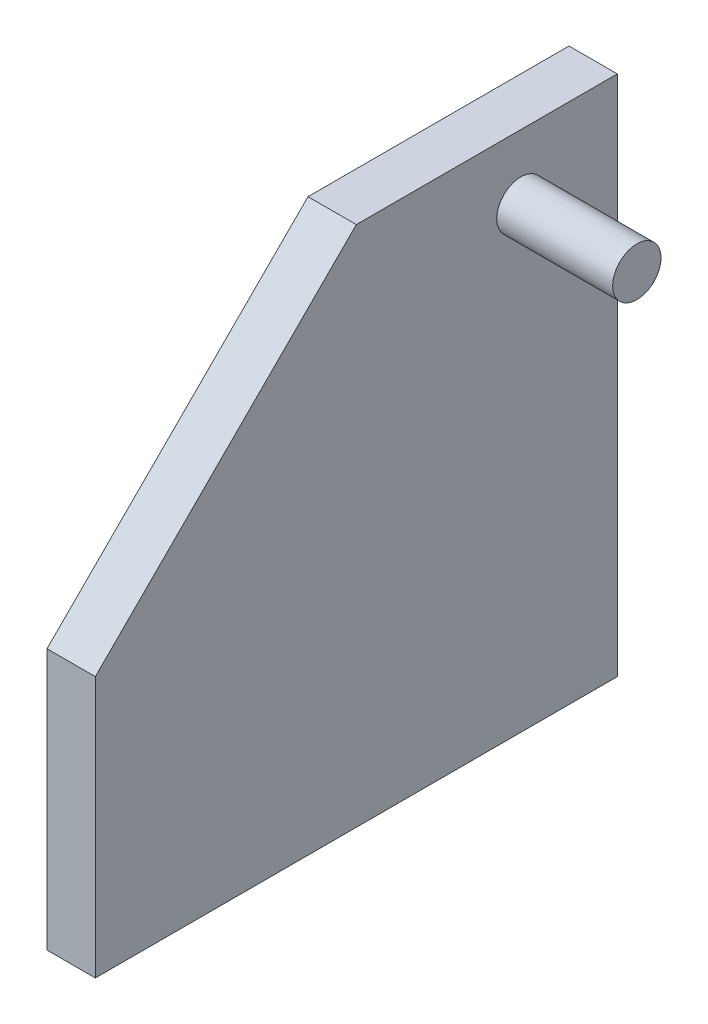
ISO-10303-21;
HEADER;
FILE_DESCRIPTION(('STEP AP214'),'2;1');
FILE_NAME('part.step','',(''),(''),'','','');
FILE_SCHEMA(('AUTOMOTIVE_DESIGN { 1 0 10303 214 1 1 1 1 }'));
ENDSEC;
DATA;
#1=APPLICATION_CONTEXT('core data for automotive mechanical design processes');
#2=APPLICATION_PROTOCOL_DEFINITION('international standard','automotive_design',2000,#1);
#3=PRODUCT_CONTEXT('',#1,'mechanical');
#4=PRODUCT('Part','Part','',(#3));
#5=PRODUCT_RELATED_PRODUCT_CATEGORY('part','',(#4));
#6=PRODUCT_DEFINITION_FORMATION('','',#4);
#7=PRODUCT_DEFINITION_CONTEXT('part definition',#1,'design');
#8=PRODUCT_DEFINITION('design','',#6,#7);
#9=PRODUCT_DEFINITION_SHAPE('','',#8);
#10=(LENGTH_UNIT() NAMED_UNIT(*) SI_UNIT(.MILLI.,.METRE.));
#11=(NAMED_UNIT(*) PLANE_ANGLE_UNIT() SI_UNIT($,.RADIAN.));
#12=(NAMED_UNIT(*) SI_UNIT($,.STERADIAN.) SOLID_ANGLE_UNIT());
#13=UNCERTAINTY_MEASURE_WITH_UNIT(LENGTH_MEASURE(1.E-05),#10,'distance_accuracy_value','');
#14=(GEOMETRIC_REPRESENTATION_CONTEXT(3) GLOBAL_UNCERTAINTY_ASSIGNED_CONTEXT((#13)) GLOBAL_UNIT_ASSIGNED_CONTEXT((#10,
#11,#12)) REPRESENTATION_CONTEXT('',''));
#15=CARTESIAN_POINT('',(0.,0.,0.));
#16=DIRECTION('',(0.,0.,1.));
#17=DIRECTION('',(1.,0.,0.));
#18=AXIS2_PLACEMENT_3D('',#15,#16,#17);
#19=CARTESIAN_POINT('',(2.5,0.,0.));
#20=DIRECTION('',(-1.,0.,0.));
#21=DIRECTION('',(0.,0.,1.));
#22=AXIS2_PLACEMENT_3D('',#19,#20,#21);
#23=PLANE('',#22);
#24=DIRECTION('',(0.,0.,1.));
#25=VECTOR('',#24,1.);
#26=CARTESIAN_POINT('',(2.5,8.02387224995378,42.2709604363099));
#27=LINE('',#26,#25);
#28=CARTESIAN_POINT('',(2.5,8.02387224995378,15.2709604363099));
#29=VERTEX_POINT('',#28);
#30=CARTESIAN_POINT('',(2.5,8.02387224995378,28.7709604363099));
#31=VERTEX_POINT('',#30);
#32=EDGE_CURVE('E115',#29,#31,#27,.T.);
#33=ORIENTED_EDGE('',*,*,#32,.T.);
#34=DIRECTION('',(0.,0.707106781186548,-0.707106781186547));
#35=VECTOR('',#34,1.);
#36=CARTESIAN_POINT('',(2.5,-5.47612775004622,42.2709604363099));
#37=LINE('',#36,#35);
#38=CARTESIAN_POINT('',(2.5,-5.47612775004622,42.2709604363099));
#39=VERTEX_POINT('',#38);
#40=EDGE_CURVE('E104',#39,#31,#37,.T.);
#41=ORIENTED_EDGE('',*,*,#40,.F.);
#42=DIRECTION('',(0.,-1.,0.));
#43=VECTOR('',#42,1.);
#44=CARTESIAN_POINT('',(2.5,-18.9761277500462,42.2709604363099));
#45=LINE('',#44,#43);
#46=CARTESIAN_POINT('',(2.5,-18.9761277500462,42.2709604363099));
#47=VERTEX_POINT('',#46);
#48=EDGE_CURVE('E112',#39,#47,#45,.T.);
#49=ORIENTED_EDGE('',*,*,#48,.T.);
#50=DIRECTION('',(0.,0.,-1.));
#51=VECTOR('',#50,1.);
#52=CARTESIAN_POINT('',(2.5,-18.9761277500462,42.2709604363099));
#53=LINE('',#52,#51);
#54=CARTESIAN_POINT('',(2.5,-18.9761277500462,15.2709604363099));
#55=VERTEX_POINT('',#54);
#56=EDGE_CURVE('E120',#47,#55,#53,.T.);
#57=ORIENTED_EDGE('',*,*,#56,.T.);
#58=DIRECTION('',(0.,1.,0.));
#59=VECTOR('',#58,1.);
#60=CARTESIAN_POINT('',(2.5,-18.9761277500462,15.2709604363099));
#61=LINE('',#60,#59);
#62=EDGE_CURVE('E123',#55,#29,#61,.T.);
#63=ORIENTED_EDGE('',*,*,#62,.T.);
#64=EDGE_LOOP('',(#33,#41,#49,#57,#63));
#65=FACE_BOUND('',#64,.T.);
#66=CARTESIAN_POINT('',(2.5,4.65387224995378,20.2609604363099));
#67=DIRECTION('',(-1.,0.,0.));
#68=DIRECTION('',(0.,0.,1.));
#69=AXIS2_PLACEMENT_3D('',#66,#67,#68);
#70=CIRCLE('',#69,1.25);
#71=CARTESIAN_POINT('',(2.5,4.65387224995378,21.5109604363099));
#72=VERTEX_POINT('',#71);
#73=EDGE_CURVE('E41',#72,#72,#70,.F.);
#74=ORIENTED_EDGE('',*,*,#73,.F.);
#75=EDGE_LOOP('',(#74));
#76=FACE_BOUND('',#75,.T.);
#77=ADVANCED_FACE('F33',(#65,#76),#23,.F.);
#78=CARTESIAN_POINT('',(2.5,-18.9761277500462,42.2709604363099));
#79=DIRECTION('',(0.,0.,-1.));
#80=DIRECTION('',(-1.,0.,0.));
#81=AXIS2_PLACEMENT_3D('',#78,#79,#80);
#82=PLANE('',#81);
#83=ORIENTED_EDGE('',*,*,#48,.F.);
#84=DIRECTION('',(1.,0.,0.));
#85=VECTOR('',#84,1.);
#86=CARTESIAN_POINT('',(-7.000025,-5.47612775004622,42.2709604363099));
#87=LINE('',#86,#85);
#88=CARTESIAN_POINT('',(0.,-5.47612775004622,42.2709604363099));
#89=VERTEX_POINT('',#88);
#90=EDGE_CURVE('E101',#89,#39,#87,.T.);
#91=ORIENTED_EDGE('',*,*,#90,.F.);
#92=DIRECTION('',(0.,-1.,0.));
#93=VECTOR('',#92,1.);
#94=CARTESIAN_POINT('',(0.,-18.9761277500462,42.2709604363099));
#95=LINE('',#94,#93);
#96=CARTESIAN_POINT('',(0.,-18.9761277500462,42.2709604363099));
#97=VERTEX_POINT('',#96);
#98=EDGE_CURVE('E135',#89,#97,#95,.T.);
#99=ORIENTED_EDGE('',*,*,#98,.T.);
#100=DIRECTION('',(-1.,0.,0.));
#101=VECTOR('',#100,1.);
#102=CARTESIAN_POINT('',(2.5,-18.9761277500462,42.2709604363099));
#103=LINE('',#102,#101);
#104=EDGE_CURVE('E119',#47,#97,#103,.T.);
#105=ORIENTED_EDGE('',*,*,#104,.F.);
#106=EDGE_LOOP('',(#83,#91,#99,#105));
#107=FACE_BOUND('',#106,.T.);
#108=ADVANCED_FACE('F35',(#107),#82,.F.);
#109=CARTESIAN_POINT('',(2.5,-18.9761277500462,42.2709604363099));
#110=DIRECTION('',(0.,1.,0.));
#111=DIRECTION('',(0.,0.,1.));
#112=AXIS2_PLACEMENT_3D('',#109,#110,#111);
#113=PLANE('',#112);
#114=DIRECTION('',(0.,0.,-1.));
#115=VECTOR('',#114,1.);
#116=CARTESIAN_POINT('',(0.,-18.9761277500462,42.2709604363099));
#117=LINE('',#116,#115);
#118=CARTESIAN_POINT('',(0.,-18.9761277500462,32.2709604363099));
#119=VERTEX_POINT('',#118);
#120=EDGE_CURVE('E144',#97,#119,#117,.T.);
#121=ORIENTED_EDGE('',*,*,#120,.T.);
#122=DIRECTION('',(1.,0.,0.));
#123=VECTOR('',#122,1.);
#124=CARTESIAN_POINT('',(-7.,-18.9761277500462,32.2709604363099));
#125=LINE('',#124,#123);
#126=CARTESIAN_POINT('',(-7.,-18.9761277500462,32.2709604363099));
#127=VERTEX_POINT('',#126);
#128=EDGE_CURVE('E204',#127,#119,#125,.T.);
#129=ORIENTED_EDGE('',*,*,#128,.F.);
#130=DIRECTION('',(0.,0.,1.));
#131=VECTOR('',#130,1.);
#132=CARTESIAN_POINT('',(-7.,-18.9761277500462,22.2709604363099));
#133=LINE('',#132,#131);
#134=CARTESIAN_POINT('',(-7.,-18.9761277500462,22.2709604363099));
#135=VERTEX_POINT('',#134);
#136=EDGE_CURVE('E236',#135,#127,#133,.T.);
#137=ORIENTED_EDGE('',*,*,#136,.F.);
#138=DIRECTION('',(1.,0.,0.));
#139=VECTOR('',#138,1.);
#140=CARTESIAN_POINT('',(-7.,-18.9761277500462,22.2709604363099));
#141=LINE('',#140,#139);
#142=CARTESIAN_POINT('',(0.,-18.9761277500462,22.2709604363099));
#143=VERTEX_POINT('',#142);
#144=EDGE_CURVE('E202',#135,#143,#141,.T.);
#145=ORIENTED_EDGE('',*,*,#144,.T.);
#146=CARTESIAN_POINT('',(0.,-18.9761277500462,15.2709604363099));
#147=VERTEX_POINT('',#146);
#148=EDGE_CURVE('E137',#143,#147,#117,.T.);
#149=ORIENTED_EDGE('',*,*,#148,.T.);
#150=DIRECTION('',(-1.,0.,0.));
#151=VECTOR('',#150,1.);
#152=CARTESIAN_POINT('',(2.5,-18.9761277500462,15.2709604363099));
#153=LINE('',#152,#151);
#154=EDGE_CURVE('E150',#55,#147,#153,.T.);
#155=ORIENTED_EDGE('',*,*,#154,.F.);
#156=ORIENTED_EDGE('',*,*,#56,.F.);
#157=ORIENTED_EDGE('',*,*,#104,.T.);
#158=EDGE_LOOP('',(#121,#129,#137,#145,#149,#155,#156,#157));
#159=FACE_BOUND('',#158,.T.);
#160=ADVANCED_FACE('F168',(#159),#113,.F.);
#161=CARTESIAN_POINT('',(2.5,-18.9761277500462,15.2709604363099));
#162=DIRECTION('',(0.,0.,1.));
#163=DIRECTION('',(1.,0.,0.));
#164=AXIS2_PLACEMENT_3D('',#161,#162,#163);
#165=PLANE('',#164);
#166=DIRECTION('',(0.,1.,0.));
#167=VECTOR('',#166,1.);
#168=CARTESIAN_POINT('',(0.,-18.9761277500462,15.2709604363099));
#169=LINE('',#168,#167);
#170=CARTESIAN_POINT('',(0.,8.02387224995378,15.2709604363099));
#171=VERTEX_POINT('',#170);
#172=EDGE_CURVE('E126',#147,#171,#169,.T.);
#173=ORIENTED_EDGE('',*,*,#172,.T.);
#174=DIRECTION('',(-1.,0.,0.));
#175=VECTOR('',#174,1.);
#176=CARTESIAN_POINT('',(2.5,8.02387224995378,15.2709604363099));
#177=LINE('',#176,#175);
#178=EDGE_CURVE('E134',#29,#171,#177,.T.);
#179=ORIENTED_EDGE('',*,*,#178,.F.);
#180=ORIENTED_EDGE('',*,*,#62,.F.);
#181=ORIENTED_EDGE('',*,*,#154,.T.);
#182=EDGE_LOOP('',(#173,#179,#180,#181));
#183=FACE_BOUND('',#182,.T.);
#184=ADVANCED_FACE('F170',(#183),#165,.F.);
#185=CARTESIAN_POINT('',(2.5,8.02387224995378,42.2709604363099));
#186=DIRECTION('',(0.,-1.,0.));
#187=DIRECTION('',(0.,0.,-1.));
#188=AXIS2_PLACEMENT_3D('',#185,#186,#187);
#189=PLANE('',#188);
#190=DIRECTION('',(0.,0.,1.));
#191=VECTOR('',#190,1.);
#192=CARTESIAN_POINT('',(0.,8.02387224995378,42.2709604363099));
#193=LINE('',#192,#191);
#194=CARTESIAN_POINT('',(0.,8.02387224995378,28.7709604363099));
#195=VERTEX_POINT('',#194);
#196=EDGE_CURVE('E121',#171,#195,#193,.T.);
#197=ORIENTED_EDGE('',*,*,#196,.T.);
#198=DIRECTION('',(1.,0.,0.));
#199=VECTOR('',#198,1.);
#200=CARTESIAN_POINT('',(-7.000025,8.02387224995378,28.7709604363099));
#201=LINE('',#200,#199);
#202=EDGE_CURVE('E47',#195,#31,#201,.T.);
#203=ORIENTED_EDGE('',*,*,#202,.T.);
#204=ORIENTED_EDGE('',*,*,#32,.F.);
#205=ORIENTED_EDGE('',*,*,#178,.T.);
#206=EDGE_LOOP('',(#197,#203,#204,#205));
#207=FACE_BOUND('',#206,.T.);
#208=ADVANCED_FACE('F157',(#207),#189,.F.);
#209=CARTESIAN_POINT('',(0.,0.,0.));
#210=DIRECTION('',(-1.,0.,0.));
#211=DIRECTION('',(0.,0.,1.));
#212=AXIS2_PLACEMENT_3D('',#209,#210,#211);
#213=PLANE('',#212);
#214=DIRECTION('',(0.,-0.707106781186548,0.707106781186547));
#215=VECTOR('',#214,1.);
#216=CARTESIAN_POINT('',(0.,18.3974163431318,18.3974163431318));
#217=LINE('',#216,#215);
#218=EDGE_CURVE('E11',#195,#89,#217,.T.);
#219=ORIENTED_EDGE('',*,*,#218,.F.);
#220=ORIENTED_EDGE('',*,*,#196,.F.);
#221=ORIENTED_EDGE('',*,*,#172,.F.);
#222=ORIENTED_EDGE('',*,*,#148,.F.);
#223=DIRECTION('',(0.,-1.,0.));
#224=VECTOR('',#223,1.);
#225=CARTESIAN_POINT('',(0.,-18.9761277500462,22.2709604363099));
#226=LINE('',#225,#224);
#227=CARTESIAN_POINT('',(0.,-12.9761277500462,22.2709604363099));
#228=VERTEX_POINT('',#227);
#229=EDGE_CURVE('E55',#228,#143,#226,.T.);
#230=ORIENTED_EDGE('',*,*,#229,.F.);
#231=DIRECTION('',(0.,0.,-1.));
#232=VECTOR('',#231,1.);
#233=CARTESIAN_POINT('',(0.,-12.9761277500462,22.2709604363099));
#234=LINE('',#233,#232);
#235=CARTESIAN_POINT('',(0.,-12.9761277500462,32.2709604363099));
#236=VERTEX_POINT('',#235);
#237=EDGE_CURVE('E219',#236,#228,#234,.T.);
#238=ORIENTED_EDGE('',*,*,#237,.F.);
#239=DIRECTION('',(0.,1.,0.));
#240=VECTOR('',#239,1.);
#241=CARTESIAN_POINT('',(0.,-18.9761277500462,32.2709604363099));
#242=LINE('',#241,#240);
#243=EDGE_CURVE('E164',#119,#236,#242,.T.);
#244=ORIENTED_EDGE('',*,*,#243,.F.);
#245=ORIENTED_EDGE('',*,*,#120,.F.);
#246=ORIENTED_EDGE('',*,*,#98,.F.);
#247=EDGE_LOOP('',(#219,#220,#221,#222,#230,#238,#244,#245,#246));
#248=FACE_BOUND('',#247,.T.);
#249=ADVANCED_FACE('F161',(#248),#213,.T.);
#250=CARTESIAN_POINT('',(8.5,4.65387224995378,20.2609604363099));
#251=DIRECTION('',(-1.,0.,0.));
#252=DIRECTION('',(0.,0.,1.));
#253=AXIS2_PLACEMENT_3D('',#250,#251,#252);
#254=CYLINDRICAL_SURFACE('',#253,1.25);
#255=CARTESIAN_POINT('',(8.5,4.65387224995378,20.2609604363099));
#256=DIRECTION('',(1.,0.,0.));
#257=DIRECTION('',(0.,0.,-1.));
#258=AXIS2_PLACEMENT_3D('',#255,#256,#257);
#259=CIRCLE('',#258,1.25);
#260=CARTESIAN_POINT('',(8.5,4.65387224995378,19.0109604363099));
#261=VERTEX_POINT('',#260);
#262=EDGE_CURVE('E129',#261,#261,#259,.T.);
#263=ORIENTED_EDGE('',*,*,#262,.F.);
#264=EDGE_LOOP('',(#263));
#265=FACE_BOUND('',#264,.T.);
#266=ORIENTED_EDGE('',*,*,#73,.T.);
#267=EDGE_LOOP('',(#266));
#268=FACE_BOUND('',#267,.T.);
#269=ADVANCED_FACE('F185',(#265,#268),#254,.T.);
#270=CARTESIAN_POINT('',(8.5,4.65387224995378,20.2609604363099));
#271=DIRECTION('',(1.,0.,0.));
#272=DIRECTION('',(0.,0.,-1.));
#273=AXIS2_PLACEMENT_3D('',#270,#271,#272);
#274=PLANE('',#273);
#275=ORIENTED_EDGE('',*,*,#262,.T.);
#276=EDGE_LOOP('',(#275));
#277=FACE_BOUND('',#276,.T.);
#278=ADVANCED_FACE('F191',(#277),#274,.T.);
#279=CARTESIAN_POINT('',(-7.,-18.9761277500462,22.2709604363099));
#280=DIRECTION('',(0.,0.,1.));
#281=DIRECTION('',(1.,0.,0.));
#282=AXIS2_PLACEMENT_3D('',#279,#280,#281);
#283=PLANE('',#282);
#284=ORIENTED_EDGE('',*,*,#229,.T.);
#285=ORIENTED_EDGE('',*,*,#144,.F.);
#286=DIRECTION('',(0.,-1.,0.));
#287=VECTOR('',#286,1.);
#288=CARTESIAN_POINT('',(-7.,-18.9761277500462,22.2709604363099));
#289=LINE('',#288,#287);
#290=CARTESIAN_POINT('',(-7.,-12.9761277500462,22.2709604363099));
#291=VERTEX_POINT('',#290);
#292=EDGE_CURVE('E221',#291,#135,#289,.T.);
#293=ORIENTED_EDGE('',*,*,#292,.F.);
#294=DIRECTION('',(1.,0.,0.));
#295=VECTOR('',#294,1.);
#296=CARTESIAN_POINT('',(-7.,-12.9761277500462,22.2709604363099));
#297=LINE('',#296,#295);
#298=EDGE_CURVE('E222',#291,#228,#297,.T.);
#299=ORIENTED_EDGE('',*,*,#298,.T.);
#300=EDGE_LOOP('',(#284,#285,#293,#299));
#301=FACE_BOUND('',#300,.T.);
#302=ADVANCED_FACE('F196',(#301),#283,.F.);
#303=CARTESIAN_POINT('',(-7.,-18.9761277500462,32.2709604363099));
#304=DIRECTION('',(0.,0.,-1.));
#305=DIRECTION('',(-1.,0.,0.));
#306=AXIS2_PLACEMENT_3D('',#303,#304,#305);
#307=PLANE('',#306);
#308=ORIENTED_EDGE('',*,*,#243,.T.);
#309=DIRECTION('',(1.,0.,0.));
#310=VECTOR('',#309,1.);
#311=CARTESIAN_POINT('',(-7.,-12.9761277500462,32.2709604363099));
#312=LINE('',#311,#310);
#313=CARTESIAN_POINT('',(-7.,-12.9761277500462,32.2709604363099));
#314=VERTEX_POINT('',#313);
#315=EDGE_CURVE('E207',#314,#236,#312,.T.);
#316=ORIENTED_EDGE('',*,*,#315,.F.);
#317=DIRECTION('',(0.,1.,0.));
#318=VECTOR('',#317,1.);
#319=CARTESIAN_POINT('',(-7.,-18.9761277500462,32.2709604363099));
#320=LINE('',#319,#318);
#321=EDGE_CURVE('E233',#127,#314,#320,.T.);
#322=ORIENTED_EDGE('',*,*,#321,.F.);
#323=ORIENTED_EDGE('',*,*,#128,.T.);
#324=EDGE_LOOP('',(#308,#316,#322,#323));
#325=FACE_BOUND('',#324,.T.);
#326=ADVANCED_FACE('F232',(#325),#307,.F.);
#327=CARTESIAN_POINT('',(-7.,-12.9761277500462,22.2709604363099));
#328=DIRECTION('',(0.,-1.,0.));
#329=DIRECTION('',(0.,0.,-1.));
#330=AXIS2_PLACEMENT_3D('',#327,#328,#329);
#331=PLANE('',#330);
#332=ORIENTED_EDGE('',*,*,#237,.T.);
#333=ORIENTED_EDGE('',*,*,#298,.F.);
#334=DIRECTION('',(0.,0.,-1.));
#335=VECTOR('',#334,1.);
#336=CARTESIAN_POINT('',(-7.,-12.9761277500462,22.2709604363099));
#337=LINE('',#336,#335);
#338=EDGE_CURVE('E217',#314,#291,#337,.T.);
#339=ORIENTED_EDGE('',*,*,#338,.F.);
#340=ORIENTED_EDGE('',*,*,#315,.T.);
#341=EDGE_LOOP('',(#332,#333,#339,#340));
#342=FACE_BOUND('',#341,.T.);
#343=ADVANCED_FACE('F228',(#342),#331,.F.);
#344=CARTESIAN_POINT('',(-7.,0.,0.));
#345=DIRECTION('',(1.,0.,0.));
#346=DIRECTION('',(0.,0.,-1.));
#347=AXIS2_PLACEMENT_3D('',#344,#345,#346);
#348=PLANE('',#347);
#349=ORIENTED_EDGE('',*,*,#292,.T.);
#350=ORIENTED_EDGE('',*,*,#136,.T.);
#351=ORIENTED_EDGE('',*,*,#321,.T.);
#352=ORIENTED_EDGE('',*,*,#338,.T.);
#353=EDGE_LOOP('',(#349,#350,#351,#352));
#354=FACE_BOUND('',#353,.T.);
#355=ADVANCED_FACE('F241',(#354),#348,.F.);
#356=CARTESIAN_POINT('',(-7.000025,-5.47612775004622,42.2709604363099));
#357=DIRECTION('',(0.,-0.707106781186547,-0.707106781186548));
#358=DIRECTION('',(0.,0.707106781186548,-0.707106781186547));
#359=AXIS2_PLACEMENT_3D('',#356,#357,#358);
#360=PLANE('',#359);
#361=ORIENTED_EDGE('',*,*,#218,.T.);
#362=ORIENTED_EDGE('',*,*,#90,.T.);
#363=ORIENTED_EDGE('',*,*,#40,.T.);
#364=ORIENTED_EDGE('',*,*,#202,.F.);
#365=EDGE_LOOP('',(#361,#362,#363,#364));
#366=FACE_BOUND('',#365,.T.);
#367=ADVANCED_FACE('F103',(#366),#360,.F.);
#368=CLOSED_SHELL('',(#77,#108,#160,#184,#208,#249,#269,#278,#302,#326,#343,#355,#367));
#369=MANIFOLD_SOLID_BREP('B2',#368);
#370=ADVANCED_BREP_SHAPE_REPRESENTATION('',(#18,#369),#14);
#371=SHAPE_DEFINITION_REPRESENTATION(#9,#370);
ENDSEC;
END-ISO-10303-21;
